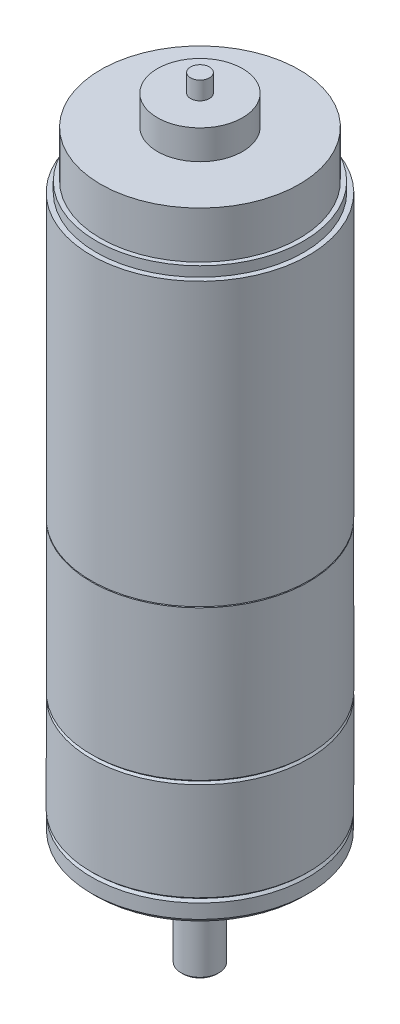
ISO-10303-21;
HEADER;
FILE_DESCRIPTION(('STEP AP214'),'2;1');
FILE_NAME('part.step','',(''),(''),'','','');
FILE_SCHEMA(('AUTOMOTIVE_DESIGN { 1 0 10303 214 1 1 1 1 }'));
ENDSEC;
DATA;
#1=APPLICATION_CONTEXT('core data for automotive mechanical design processes');
#2=APPLICATION_PROTOCOL_DEFINITION('international standard','automotive_design',2000,#1);
#3=PRODUCT_CONTEXT('',#1,'mechanical');
#4=PRODUCT('Part','Part','',(#3));
#5=PRODUCT_RELATED_PRODUCT_CATEGORY('part','',(#4));
#6=PRODUCT_DEFINITION_FORMATION('','',#4);
#7=PRODUCT_DEFINITION_CONTEXT('part definition',#1,'design');
#8=PRODUCT_DEFINITION('design','',#6,#7);
#9=PRODUCT_DEFINITION_SHAPE('','',#8);
#10=(LENGTH_UNIT() NAMED_UNIT(*) SI_UNIT(.MILLI.,.METRE.));
#11=(NAMED_UNIT(*) PLANE_ANGLE_UNIT() SI_UNIT($,.RADIAN.));
#12=(NAMED_UNIT(*) SI_UNIT($,.STERADIAN.) SOLID_ANGLE_UNIT());
#13=UNCERTAINTY_MEASURE_WITH_UNIT(LENGTH_MEASURE(1.E-05),#10,'distance_accuracy_value','');
#14=(GEOMETRIC_REPRESENTATION_CONTEXT(3) GLOBAL_UNCERTAINTY_ASSIGNED_CONTEXT((#13)) GLOBAL_UNIT_ASSIGNED_CONTEXT((#10,
#11,#12)) REPRESENTATION_CONTEXT('',''));
#15=CARTESIAN_POINT('',(0.,0.,0.));
#16=DIRECTION('',(0.,0.,1.));
#17=DIRECTION('',(1.,0.,0.));
#18=AXIS2_PLACEMENT_3D('',#15,#16,#17);
#19=CARTESIAN_POINT('',(0.,-14.,0.));
#20=DIRECTION('',(0.,1.,0.));
#21=DIRECTION('',(0.,0.,1.));
#22=AXIS2_PLACEMENT_3D('',#19,#20,#21);
#23=PLANE('',#22);
#24=CARTESIAN_POINT('',(0.,-14.0000000001237,0.));
#25=DIRECTION('',(0.,1.,0.));
#26=DIRECTION('',(0.,0.,1.));
#27=AXIS2_PLACEMENT_3D('',#24,#25,#26);
#28=CIRCLE('',#27,1.80000000023028);
#29=CARTESIAN_POINT('',(-1.4,-14.0000000001857,1.1313708501662));
#30=VERTEX_POINT('',#29);
#31=CARTESIAN_POINT('',(-1.4,-14.0000000000618,-1.13137085036326));
#32=VERTEX_POINT('',#31);
#33=EDGE_CURVE('E19',#30,#32,#28,.T.);
#34=ORIENTED_EDGE('',*,*,#33,.F.);
#35=DIRECTION('',(0.,0.,-1.));
#36=VECTOR('',#35,1.);
#37=CARTESIAN_POINT('',(-1.4,-14.,1.42828568570857));
#38=LINE('',#37,#36);
#39=EDGE_CURVE('E50',#30,#32,#38,.T.);
#40=ORIENTED_EDGE('',*,*,#39,.T.);
#41=EDGE_LOOP('',(#34,#40));
#42=FACE_BOUND('',#41,.T.);
#43=ADVANCED_FACE('F16',(#42),#23,.F.);
#44=CARTESIAN_POINT('',(0.,-13.8000000001739,0.));
#45=DIRECTION('',(0.,1.,0.));
#46=DIRECTION('',(0.,0.,1.));
#47=AXIS2_PLACEMENT_3D('',#44,#45,#46);
#48=CONICAL_SURFACE('',#47,1.99999999983902,0.785398162544797);
#49=CARTESIAN_POINT('',(-1.39999999995659,-14.0000000002279,-1.13137085005512));
#50=CARTESIAN_POINT('',(-1.39999999998432,-13.9841188437741,-1.1566353082275));
#51=CARTESIAN_POINT('',(-1.39999999999578,-13.9680096289815,-1.18175530232964));
#52=CARTESIAN_POINT('',(-1.40000000000422,-13.9353865044478,-1.23172354645879));
#53=CARTESIAN_POINT('',(-1.40000000000121,-13.9188726828804,-1.25657185401566));
#54=CARTESIAN_POINT('',(-1.39999999999879,-13.8854854387172,-1.30602395335101));
#55=CARTESIAN_POINT('',(-1.3999999999994,-13.8686120285243,-1.33062775352023));
#56=CARTESIAN_POINT('',(-1.4000000000006,-13.8345397217204,-1.37961693764071));
#57=CARTESIAN_POINT('',(-1.40000000000121,-13.8173407556094,-1.40400227327899));
#58=CARTESIAN_POINT('',(-1.4,-13.8000000000089,-1.42828568571488));
#59=B_SPLINE_CURVE_WITH_KNOTS('',3,(#49,#50,#51,#52,#53,#54,#55,#56,#57,#58),.UNSPECIFIED.,.F.,
.F.,(4,2,2,2,4),(0.,0.0895213707346501,0.179023403090901,0.268522353330887,0.358040630324946),.UNSPECIFIED.);
#60=CARTESIAN_POINT('',(-1.4,-13.8000000000043,-1.42828568571163));
#61=VERTEX_POINT('',#60);
#62=EDGE_CURVE('E52',#32,#61,#59,.T.);
#63=ORIENTED_EDGE('',*,*,#62,.T.);
#64=CARTESIAN_POINT('',(0.,-13.8,0.));
#65=DIRECTION('',(0.,1.,0.));
#66=DIRECTION('',(0.,0.,1.));
#67=AXIS2_PLACEMENT_3D('',#64,#65,#66);
#68=CIRCLE('',#67,2.);
#69=CARTESIAN_POINT('',(-1.4,-13.8000000000043,1.42828568571162));
#70=VERTEX_POINT('',#69);
#71=EDGE_CURVE('E380',#70,#61,#68,.T.);
#72=ORIENTED_EDGE('',*,*,#71,.F.);
#73=CARTESIAN_POINT('',(-1.4,-13.8000000000086,1.42828568571468));
#74=CARTESIAN_POINT('',(-1.4,-13.8173407556087,1.40400227327863));
#75=CARTESIAN_POINT('',(-1.4,-13.83453972172,1.37961693764065));
#76=CARTESIAN_POINT('',(-1.4,-13.8686120285244,1.33062775352066));
#77=CARTESIAN_POINT('',(-1.4,-13.8854854387176,1.30602395335163));
#78=CARTESIAN_POINT('',(-1.4,-13.9188726828796,1.25657185401565));
#79=CARTESIAN_POINT('',(-1.4,-13.9353865044455,1.23172354645797));
#80=CARTESIAN_POINT('',(-1.4,-13.9680096289831,1.18175530233164));
#81=CARTESIAN_POINT('',(-1.4,-13.984118843781,1.15663530823313));
#82=CARTESIAN_POINT('',(-1.4,-14.0000000002478,1.13137085006932));
#83=B_SPLINE_CURVE_WITH_KNOTS('',3,(#73,#74,#75,#76,#77,#78,#79,#80,#81,#82),.UNSPECIFIED.,.F.,
.F.,(4,2,2,2,4),(0.,0.0895182769938151,0.179017227233742,0.268519259589643,0.358040630323742),.UNSPECIFIED.);
#84=EDGE_CURVE('E53',#70,#30,#83,.T.);
#85=ORIENTED_EDGE('',*,*,#84,.T.);
#86=ORIENTED_EDGE('',*,*,#33,.T.);
#87=EDGE_LOOP('',(#63,#72,#85,#86));
#88=FACE_BOUND('',#87,.T.);
#89=ADVANCED_FACE('F56',(#88),#48,.T.);
#90=CARTESIAN_POINT('',(-1.4,-16.26,1.42828568570857));
#91=DIRECTION('',(1.,0.,0.));
#92=DIRECTION('',(0.,0.,-1.));
#93=AXIS2_PLACEMENT_3D('',#90,#91,#92);
#94=PLANE('',#93);
#95=ORIENTED_EDGE('',*,*,#62,.F.);
#96=ORIENTED_EDGE('',*,*,#39,.F.);
#97=ORIENTED_EDGE('',*,*,#84,.F.);
#98=DIRECTION('',(0.,1.,0.));
#99=VECTOR('',#98,1.);
#100=CARTESIAN_POINT('',(-1.4,-14.,1.42828568570857));
#101=LINE('',#100,#99);
#102=CARTESIAN_POINT('',(-1.4,-8.,1.42828568570857));
#103=VERTEX_POINT('',#102);
#104=EDGE_CURVE('E63',#103,#70,#101,.F.);
#105=ORIENTED_EDGE('',*,*,#104,.F.);
#106=DIRECTION('',(0.,0.,1.));
#107=VECTOR('',#106,1.);
#108=CARTESIAN_POINT('',(-1.4,-8.,0.));
#109=LINE('',#108,#107);
#110=CARTESIAN_POINT('',(-1.4,-8.,-1.42828568570857));
#111=VERTEX_POINT('',#110);
#112=EDGE_CURVE('E34',#103,#111,#109,.F.);
#113=ORIENTED_EDGE('',*,*,#112,.T.);
#114=DIRECTION('',(0.,1.,0.));
#115=VECTOR('',#114,1.);
#116=CARTESIAN_POINT('',(-1.4,-14.,-1.42828568570857));
#117=LINE('',#116,#115);
#118=EDGE_CURVE('E60',#61,#111,#117,.T.);
#119=ORIENTED_EDGE('',*,*,#118,.F.);
#120=EDGE_LOOP('',(#95,#96,#97,#105,#113,#119));
#121=FACE_BOUND('',#120,.T.);
#122=ADVANCED_FACE('F58',(#121),#94,.F.);
#123=CARTESIAN_POINT('',(0.,-8.,0.));
#124=DIRECTION('',(0.,1.,0.));
#125=DIRECTION('',(0.,0.,1.));
#126=AXIS2_PLACEMENT_3D('',#123,#124,#125);
#127=PLANE('',#126);
#128=CARTESIAN_POINT('',(0.,-8.,0.));
#129=DIRECTION('',(0.,1.,0.));
#130=DIRECTION('',(0.,0.,1.));
#131=AXIS2_PLACEMENT_3D('',#128,#129,#130);
#132=CIRCLE('',#131,2.);
#133=EDGE_CURVE('E71',#111,#103,#132,.T.);
#134=ORIENTED_EDGE('',*,*,#133,.F.);
#135=ORIENTED_EDGE('',*,*,#112,.F.);
#136=EDGE_LOOP('',(#134,#135));
#137=FACE_BOUND('',#136,.T.);
#138=ADVANCED_FACE('F87',(#137),#127,.F.);
#139=CARTESIAN_POINT('',(0.,-14.,0.));
#140=DIRECTION('',(0.,1.,0.));
#141=DIRECTION('',(0.,0.,1.));
#142=AXIS2_PLACEMENT_3D('',#139,#140,#141);
#143=CYLINDRICAL_SURFACE('',#142,2.);
#144=ORIENTED_EDGE('',*,*,#118,.T.);
#145=ORIENTED_EDGE('',*,*,#133,.T.);
#146=ORIENTED_EDGE('',*,*,#104,.T.);
#147=ORIENTED_EDGE('',*,*,#71,.T.);
#148=EDGE_LOOP('',(#144,#145,#146,#147));
#149=FACE_BOUND('',#148,.T.);
#150=CARTESIAN_POINT('',(0.,-2.9,0.));
#151=DIRECTION('',(0.,1.,0.));
#152=DIRECTION('',(0.,0.,1.));
#153=AXIS2_PLACEMENT_3D('',#150,#151,#152);
#154=CIRCLE('',#153,2.);
#155=CARTESIAN_POINT('',(0.,-2.9,1.99999999999999));
#156=VERTEX_POINT('',#155);
#157=EDGE_CURVE('E360',#156,#156,#154,.T.);
#158=ORIENTED_EDGE('',*,*,#157,.F.);
#159=EDGE_LOOP('',(#158));
#160=FACE_BOUND('',#159,.T.);
#161=ADVANCED_FACE('F366',(#149,#160),#143,.T.);
#162=CARTESIAN_POINT('',(0.,-2.9,0.));
#163=DIRECTION('',(0.,1.,0.));
#164=DIRECTION('',(0.,0.,1.));
#165=AXIS2_PLACEMENT_3D('',#162,#163,#164);
#166=TOROIDAL_SURFACE('',#165,2.2,0.2);
#167=ORIENTED_EDGE('',*,*,#157,.T.);
#168=EDGE_LOOP('',(#167));
#169=FACE_BOUND('',#168,.T.);
#170=CARTESIAN_POINT('',(0.,-3.1,0.));
#171=DIRECTION('',(0.,-1.,0.));
#172=DIRECTION('',(0.,0.,1.));
#173=AXIS2_PLACEMENT_3D('',#170,#171,#172);
#174=CIRCLE('',#173,2.2);
#175=CARTESIAN_POINT('',(0.,-3.1,2.19999999999999));
#176=VERTEX_POINT('',#175);
#177=EDGE_CURVE('E499',#176,#176,#174,.T.);
#178=ORIENTED_EDGE('',*,*,#177,.T.);
#179=EDGE_LOOP('',(#178));
#180=FACE_BOUND('',#179,.T.);
#181=ADVANCED_FACE('F362',(#169,#180),#166,.T.);
#182=CARTESIAN_POINT('',(0.,-3.1,2.99999999999999));
#183=DIRECTION('',(0.,1.,0.));
#184=DIRECTION('',(0.,0.,1.));
#185=AXIS2_PLACEMENT_3D('',#182,#183,#184);
#186=PLANE('',#185);
#187=CARTESIAN_POINT('',(0.,-3.1,0.));
#188=DIRECTION('',(0.,1.,0.));
#189=DIRECTION('',(0.,0.,1.));
#190=AXIS2_PLACEMENT_3D('',#187,#188,#189);
#191=CIRCLE('',#190,2.9);
#192=CARTESIAN_POINT('',(0.,-3.1,2.89999999999999));
#193=VERTEX_POINT('',#192);
#194=EDGE_CURVE('E321',#193,#193,#191,.T.);
#195=ORIENTED_EDGE('',*,*,#194,.F.);
#196=EDGE_LOOP('',(#195));
#197=FACE_BOUND('',#196,.T.);
#198=ORIENTED_EDGE('',*,*,#177,.F.);
#199=EDGE_LOOP('',(#198));
#200=FACE_BOUND('',#199,.T.);
#201=ADVANCED_FACE('F342',(#197,#200),#186,.F.);
#202=CARTESIAN_POINT('',(0.,-3.,0.));
#203=DIRECTION('',(0.,1.,0.));
#204=DIRECTION('',(0.,0.,1.));
#205=AXIS2_PLACEMENT_3D('',#202,#203,#204);
#206=TOROIDAL_SURFACE('',#205,2.9,0.1);
#207=CARTESIAN_POINT('',(0.,-3.,0.));
#208=DIRECTION('',(0.,1.,0.));
#209=DIRECTION('',(0.,0.,1.));
#210=AXIS2_PLACEMENT_3D('',#207,#208,#209);
#211=CIRCLE('',#210,3.);
#212=CARTESIAN_POINT('',(0.,-3.,2.99999999999999));
#213=VERTEX_POINT('',#212);
#214=EDGE_CURVE('E318',#213,#213,#211,.F.);
#215=ORIENTED_EDGE('',*,*,#214,.T.);
#216=EDGE_LOOP('',(#215));
#217=FACE_BOUND('',#216,.T.);
#218=ORIENTED_EDGE('',*,*,#194,.T.);
#219=EDGE_LOOP('',(#218));
#220=FACE_BOUND('',#219,.T.);
#221=ADVANCED_FACE('F338',(#217,#220),#206,.T.);
#222=CARTESIAN_POINT('',(0.,-3.,0.));
#223=DIRECTION('',(0.,1.,0.));
#224=DIRECTION('',(0.,0.,1.));
#225=AXIS2_PLACEMENT_3D('',#222,#223,#224);
#226=TOROIDAL_SURFACE('',#225,3.1,0.1);
#227=ORIENTED_EDGE('',*,*,#214,.F.);
#228=EDGE_LOOP('',(#227));
#229=FACE_BOUND('',#228,.T.);
#230=CARTESIAN_POINT('',(0.,-2.9,0.));
#231=DIRECTION('',(0.,-1.,0.));
#232=DIRECTION('',(0.,0.,1.));
#233=AXIS2_PLACEMENT_3D('',#230,#231,#232);
#234=CIRCLE('',#233,3.1);
#235=CARTESIAN_POINT('',(0.,-2.9,3.09999999999999));
#236=VERTEX_POINT('',#235);
#237=EDGE_CURVE('E276',#236,#236,#234,.T.);
#238=ORIENTED_EDGE('',*,*,#237,.T.);
#239=EDGE_LOOP('',(#238));
#240=FACE_BOUND('',#239,.T.);
#241=ADVANCED_FACE('F291',(#229,#240),#226,.F.);
#242=CARTESIAN_POINT('',(0.,-2.9,4.49999999999999));
#243=DIRECTION('',(0.,1.,0.));
#244=DIRECTION('',(0.,0.,1.));
#245=AXIS2_PLACEMENT_3D('',#242,#243,#244);
#246=PLANE('',#245);
#247=CARTESIAN_POINT('',(0.,-2.9,0.));
#248=DIRECTION('',(0.,1.,0.));
#249=DIRECTION('',(0.,0.,1.));
#250=AXIS2_PLACEMENT_3D('',#247,#248,#249);
#251=CIRCLE('',#250,4.4);
#252=CARTESIAN_POINT('',(0.,-2.9,4.39999999999999));
#253=VERTEX_POINT('',#252);
#254=EDGE_CURVE('E308',#253,#253,#251,.F.);
#255=ORIENTED_EDGE('',*,*,#254,.T.);
#256=EDGE_LOOP('',(#255));
#257=FACE_BOUND('',#256,.T.);
#258=ORIENTED_EDGE('',*,*,#237,.F.);
#259=EDGE_LOOP('',(#258));
#260=FACE_BOUND('',#259,.T.);
#261=ADVANCED_FACE('F282',(#257,#260),#246,.F.);
#262=CARTESIAN_POINT('',(0.,-3.,0.));
#263=DIRECTION('',(0.,1.,0.));
#264=DIRECTION('',(0.,0.,1.));
#265=AXIS2_PLACEMENT_3D('',#262,#263,#264);
#266=TOROIDAL_SURFACE('',#265,4.4,0.1);
#267=ORIENTED_EDGE('',*,*,#254,.F.);
#268=EDGE_LOOP('',(#267));
#269=FACE_BOUND('',#268,.T.);
#270=CARTESIAN_POINT('',(0.,-3.,0.));
#271=DIRECTION('',(0.,1.,0.));
#272=DIRECTION('',(0.,0.,1.));
#273=AXIS2_PLACEMENT_3D('',#270,#271,#272);
#274=CIRCLE('',#273,4.5);
#275=CARTESIAN_POINT('',(0.,-3.,4.49999999999999));
#276=VERTEX_POINT('',#275);
#277=EDGE_CURVE('E249',#276,#276,#274,.T.);
#278=ORIENTED_EDGE('',*,*,#277,.F.);
#279=EDGE_LOOP('',(#278));
#280=FACE_BOUND('',#279,.T.);
#281=ADVANCED_FACE('F255',(#269,#280),#266,.F.);
#282=CARTESIAN_POINT('',(0.,-3.,0.));
#283=DIRECTION('',(0.,1.,0.));
#284=DIRECTION('',(0.,0.,1.));
#285=AXIS2_PLACEMENT_3D('',#282,#283,#284);
#286=TOROIDAL_SURFACE('',#285,4.6,0.1);
#287=ORIENTED_EDGE('',*,*,#277,.T.);
#288=EDGE_LOOP('',(#287));
#289=FACE_BOUND('',#288,.T.);
#290=CARTESIAN_POINT('',(0.,-3.1,0.));
#291=DIRECTION('',(0.,-1.,0.));
#292=DIRECTION('',(0.,0.,1.));
#293=AXIS2_PLACEMENT_3D('',#290,#291,#292);
#294=CIRCLE('',#293,4.6);
#295=CARTESIAN_POINT('',(0.,-3.1,4.59999999999999));
#296=VERTEX_POINT('',#295);
#297=EDGE_CURVE('E863',#296,#296,#294,.T.);
#298=ORIENTED_EDGE('',*,*,#297,.T.);
#299=EDGE_LOOP('',(#298));
#300=FACE_BOUND('',#299,.T.);
#301=ADVANCED_FACE('F251',(#289,#300),#286,.T.);
#302=CARTESIAN_POINT('',(0.,-3.1,5.79999999999999));
#303=DIRECTION('',(0.,1.,0.));
#304=DIRECTION('',(0.,0.,1.));
#305=AXIS2_PLACEMENT_3D('',#302,#303,#304);
#306=PLANE('',#305);
#307=CARTESIAN_POINT('',(0.,-3.1,0.));
#308=DIRECTION('',(0.,1.,0.));
#309=DIRECTION('',(0.,0.,1.));
#310=AXIS2_PLACEMENT_3D('',#307,#308,#309);
#311=CIRCLE('',#310,5.7);
#312=CARTESIAN_POINT('',(0.,-3.1,5.69999999999999));
#313=VERTEX_POINT('',#312);
#314=EDGE_CURVE('E218',#313,#313,#311,.T.);
#315=ORIENTED_EDGE('',*,*,#314,.F.);
#316=EDGE_LOOP('',(#315));
#317=FACE_BOUND('',#316,.T.);
#318=ORIENTED_EDGE('',*,*,#297,.F.);
#319=EDGE_LOOP('',(#318));
#320=FACE_BOUND('',#319,.T.);
#321=ADVANCED_FACE('F231',(#317,#320),#306,.F.);
#322=CARTESIAN_POINT('',(0.,-3.,0.));
#323=DIRECTION('',(0.,1.,0.));
#324=DIRECTION('',(0.,0.,1.));
#325=AXIS2_PLACEMENT_3D('',#322,#323,#324);
#326=TOROIDAL_SURFACE('',#325,5.7,0.1);
#327=ORIENTED_EDGE('',*,*,#314,.T.);
#328=EDGE_LOOP('',(#327));
#329=FACE_BOUND('',#328,.T.);
#330=CARTESIAN_POINT('',(0.,-3.,0.));
#331=DIRECTION('',(0.,-1.,0.));
#332=DIRECTION('',(0.,0.,-1.));
#333=AXIS2_PLACEMENT_3D('',#330,#331,#332);
#334=CIRCLE('',#333,5.8);
#335=CARTESIAN_POINT('',(0.,-3.,-5.80000000000001));
#336=VERTEX_POINT('',#335);
#337=EDGE_CURVE('E202',#336,#336,#334,.F.);
#338=ORIENTED_EDGE('',*,*,#337,.F.);
#339=EDGE_LOOP('',(#338));
#340=FACE_BOUND('',#339,.T.);
#341=ADVANCED_FACE('F226',(#329,#340),#326,.T.);
#342=CARTESIAN_POINT('',(0.,-3.1,0.));
#343=DIRECTION('',(0.,-1.,0.));
#344=DIRECTION('',(0.,0.,-1.));
#345=AXIS2_PLACEMENT_3D('',#342,#343,#344);
#346=CYLINDRICAL_SURFACE('',#345,5.8);
#347=ORIENTED_EDGE('',*,*,#337,.T.);
#348=EDGE_LOOP('',(#347));
#349=FACE_BOUND('',#348,.T.);
#350=CARTESIAN_POINT('',(0.,-2.4,0.));
#351=DIRECTION('',(0.,-1.,0.));
#352=DIRECTION('',(0.,0.,-1.));
#353=AXIS2_PLACEMENT_3D('',#350,#351,#352);
#354=CIRCLE('',#353,5.8);
#355=CARTESIAN_POINT('',(0.,-2.4,-5.80000000000001));
#356=VERTEX_POINT('',#355);
#357=EDGE_CURVE('E198',#356,#356,#354,.F.);
#358=ORIENTED_EDGE('',*,*,#357,.F.);
#359=EDGE_LOOP('',(#358));
#360=FACE_BOUND('',#359,.T.);
#361=ADVANCED_FACE('F230',(#349,#360),#346,.T.);
#362=CARTESIAN_POINT('',(0.,-2.4,0.));
#363=DIRECTION('',(0.,-1.,0.));
#364=DIRECTION('',(0.,0.,-1.));
#365=AXIS2_PLACEMENT_3D('',#362,#363,#364);
#366=TOROIDAL_SURFACE('',#365,5.7,0.1);
#367=ORIENTED_EDGE('',*,*,#357,.T.);
#368=EDGE_LOOP('',(#367));
#369=FACE_BOUND('',#368,.T.);
#370=CARTESIAN_POINT('',(0.,-2.3,0.));
#371=DIRECTION('',(0.,-1.,0.));
#372=DIRECTION('',(0.,0.,-1.));
#373=AXIS2_PLACEMENT_3D('',#370,#371,#372);
#374=CIRCLE('',#373,5.7);
#375=CARTESIAN_POINT('',(0.,-2.3,-5.70000000000001));
#376=VERTEX_POINT('',#375);
#377=EDGE_CURVE('E201',#376,#376,#374,.F.);
#378=ORIENTED_EDGE('',*,*,#377,.F.);
#379=EDGE_LOOP('',(#378));
#380=FACE_BOUND('',#379,.T.);
#381=ADVANCED_FACE('F180',(#369,#380),#366,.T.);
#382=CARTESIAN_POINT('',(0.,-2.3,5.));
#383=DIRECTION('',(0.,-1.,0.));
#384=DIRECTION('',(0.,0.,-1.));
#385=AXIS2_PLACEMENT_3D('',#382,#383,#384);
#386=PLANE('',#385);
#387=CARTESIAN_POINT('',(0.,-2.3,0.));
#388=DIRECTION('',(0.,1.,0.));
#389=DIRECTION('',(0.,0.,1.));
#390=AXIS2_PLACEMENT_3D('',#387,#388,#389);
#391=CIRCLE('',#390,10.97);
#392=CARTESIAN_POINT('',(0.,-2.3,10.97));
#393=VERTEX_POINT('',#392);
#394=EDGE_CURVE('E424',#393,#393,#391,.T.);
#395=ORIENTED_EDGE('',*,*,#394,.F.);
#396=EDGE_LOOP('',(#395));
#397=FACE_BOUND('',#396,.T.);
#398=ORIENTED_EDGE('',*,*,#377,.T.);
#399=EDGE_LOOP('',(#398));
#400=FACE_BOUND('',#399,.T.);
#401=ADVANCED_FACE('F175',(#397,#400),#386,.T.);
#402=CARTESIAN_POINT('',(0.,-1.79999999955128,0.));
#403=DIRECTION('',(0.,1.,0.));
#404=DIRECTION('',(0.,0.,1.));
#405=AXIS2_PLACEMENT_3D('',#402,#403,#404);
#406=CONICAL_SURFACE('',#405,11.4699999995513,0.785398162499998);
#407=ORIENTED_EDGE('',*,*,#394,.T.);
#408=EDGE_LOOP('',(#407));
#409=FACE_BOUND('',#408,.T.);
#410=CARTESIAN_POINT('',(0.,-1.8,0.));
#411=DIRECTION('',(0.,-1.,0.));
#412=DIRECTION('',(0.,0.,-1.));
#413=AXIS2_PLACEMENT_3D('',#410,#411,#412);
#414=CIRCLE('',#413,11.47);
#415=CARTESIAN_POINT('',(0.,-1.8,-11.47));
#416=VERTEX_POINT('',#415);
#417=EDGE_CURVE('E426',#416,#416,#414,.F.);
#418=ORIENTED_EDGE('',*,*,#417,.F.);
#419=EDGE_LOOP('',(#418));
#420=FACE_BOUND('',#419,.T.);
#421=ADVANCED_FACE('F171',(#409,#420),#406,.T.);
#422=CARTESIAN_POINT('',(0.,19.3,0.));
#423=DIRECTION('',(0.,-1.,0.));
#424=DIRECTION('',(0.,0.,-1.));
#425=AXIS2_PLACEMENT_3D('',#422,#423,#424);
#426=CYLINDRICAL_SURFACE('',#425,11.47);
#427=CARTESIAN_POINT('',(0.,-0.300000000000002,0.));
#428=DIRECTION('',(0.,-1.,0.));
#429=DIRECTION('',(0.,0.,-1.));
#430=AXIS2_PLACEMENT_3D('',#427,#428,#429);
#431=CIRCLE('',#430,11.47);
#432=CARTESIAN_POINT('',(0.,-0.299999999999999,-11.47));
#433=VERTEX_POINT('',#432);
#434=EDGE_CURVE('E423',#433,#433,#431,.F.);
#435=ORIENTED_EDGE('',*,*,#434,.F.);
#436=EDGE_LOOP('',(#435));
#437=FACE_BOUND('',#436,.T.);
#438=ORIENTED_EDGE('',*,*,#417,.T.);
#439=EDGE_LOOP('',(#438));
#440=FACE_BOUND('',#439,.T.);
#441=ADVANCED_FACE('F167',(#437,#440),#426,.T.);
#442=CARTESIAN_POINT('',(0.,67.65,0.));
#443=DIRECTION('',(0.,-1.,0.));
#444=DIRECTION('',(0.,0.,-1.));
#445=AXIS2_PLACEMENT_3D('',#442,#443,#444);
#446=PLANE('',#445);
#447=CARTESIAN_POINT('',(0.,67.65,0.));
#448=DIRECTION('',(0.,-1.,0.));
#449=DIRECTION('',(0.,0.,-1.));
#450=AXIS2_PLACEMENT_3D('',#447,#448,#449);
#451=CIRCLE('',#450,1.);
#452=CARTESIAN_POINT('',(0.,67.65,-1.));
#453=VERTEX_POINT('',#452);
#454=EDGE_CURVE('E421',#453,#453,#451,.T.);
#455=ORIENTED_EDGE('',*,*,#454,.F.);
#456=EDGE_LOOP('',(#455));
#457=FACE_BOUND('',#456,.T.);
#458=ADVANCED_FACE('F163',(#457),#446,.F.);
#459=CARTESIAN_POINT('',(0.,-0.300000000000002,0.));
#460=DIRECTION('',(0.,-1.,0.));
#461=DIRECTION('',(0.,0.,-1.));
#462=AXIS2_PLACEMENT_3D('',#459,#460,#461);
#463=CONICAL_SURFACE('',#462,11.47,0.785398162499996);
#464=ORIENTED_EDGE('',*,*,#434,.T.);
#465=EDGE_LOOP('',(#464));
#466=FACE_BOUND('',#465,.T.);
#467=CARTESIAN_POINT('',(0.,2.69233095019639E-10,0.));
#468=DIRECTION('',(0.,-1.,0.));
#469=DIRECTION('',(0.,0.,-1.));
#470=AXIS2_PLACEMENT_3D('',#467,#468,#469);
#471=CIRCLE('',#470,11.1700000002692);
#472=CARTESIAN_POINT('',(0.,2.69236552910905E-10,-11.1700000002692));
#473=VERTEX_POINT('',#472);
#474=EDGE_CURVE('E418',#473,#473,#471,.F.);
#475=ORIENTED_EDGE('',*,*,#474,.F.);
#476=EDGE_LOOP('',(#475));
#477=FACE_BOUND('',#476,.T.);
#478=ADVANCED_FACE('F159',(#466,#477),#463,.T.);
#479=CARTESIAN_POINT('',(0.,67.65,0.));
#480=DIRECTION('',(0.,-1.,0.));
#481=DIRECTION('',(0.,0.,-1.));
#482=AXIS2_PLACEMENT_3D('',#479,#480,#481);
#483=CYLINDRICAL_SURFACE('',#482,1.);
#484=CARTESIAN_POINT('',(0.,65.75,0.));
#485=DIRECTION('',(0.,-1.,0.));
#486=DIRECTION('',(0.,0.,-1.));
#487=AXIS2_PLACEMENT_3D('',#484,#485,#486);
#488=CIRCLE('',#487,1.);
#489=CARTESIAN_POINT('',(0.,65.75,-1.));
#490=VERTEX_POINT('',#489);
#491=EDGE_CURVE('E415',#490,#490,#488,.F.);
#492=ORIENTED_EDGE('',*,*,#491,.T.);
#493=EDGE_LOOP('',(#492));
#494=FACE_BOUND('',#493,.T.);
#495=ORIENTED_EDGE('',*,*,#454,.T.);
#496=EDGE_LOOP('',(#495));
#497=FACE_BOUND('',#496,.T.);
#498=ADVANCED_FACE('F155',(#494,#497),#483,.T.);
#499=CARTESIAN_POINT('',(0.,0.,9.5));
#500=DIRECTION('',(0.,-1.,0.));
#501=DIRECTION('',(0.,0.,-1.));
#502=AXIS2_PLACEMENT_3D('',#499,#500,#501);
#503=PLANE('',#502);
#504=CARTESIAN_POINT('',(0.,0.,0.));
#505=DIRECTION('',(0.,1.,0.));
#506=DIRECTION('',(0.,0.,1.));
#507=AXIS2_PLACEMENT_3D('',#504,#505,#506);
#508=CIRCLE('',#507,11.3);
#509=CARTESIAN_POINT('',(0.,0.,11.3));
#510=VERTEX_POINT('',#509);
#511=EDGE_CURVE('E412',#510,#510,#508,.T.);
#512=ORIENTED_EDGE('',*,*,#511,.F.);
#513=EDGE_LOOP('',(#512));
#514=FACE_BOUND('',#513,.T.);
#515=ORIENTED_EDGE('',*,*,#474,.T.);
#516=EDGE_LOOP('',(#515));
#517=FACE_BOUND('',#516,.T.);
#518=ADVANCED_FACE('F151',(#514,#517),#503,.T.);
#519=CARTESIAN_POINT('',(0.,65.75,0.));
#520=DIRECTION('',(0.,-1.,0.));
#521=DIRECTION('',(0.,0.,-1.));
#522=AXIS2_PLACEMENT_3D('',#519,#520,#521);
#523=PLANE('',#522);
#524=CARTESIAN_POINT('',(0.,65.75,0.));
#525=DIRECTION('',(0.,-1.,0.));
#526=DIRECTION('',(0.,0.,-1.));
#527=AXIS2_PLACEMENT_3D('',#524,#525,#526);
#528=CIRCLE('',#527,4.5);
#529=CARTESIAN_POINT('',(0.,65.75,-4.5));
#530=VERTEX_POINT('',#529);
#531=EDGE_CURVE('E409',#530,#530,#528,.T.);
#532=ORIENTED_EDGE('',*,*,#531,.F.);
#533=EDGE_LOOP('',(#532));
#534=FACE_BOUND('',#533,.T.);
#535=ORIENTED_EDGE('',*,*,#491,.F.);
#536=EDGE_LOOP('',(#535));
#537=FACE_BOUND('',#536,.T.);
#538=ADVANCED_FACE('F147',(#534,#537),#523,.F.);
#539=CARTESIAN_POINT('',(0.,0.200000000179489,0.));
#540=DIRECTION('',(0.,1.,0.));
#541=DIRECTION('',(0.,0.,1.));
#542=AXIS2_PLACEMENT_3D('',#539,#540,#541);
#543=CONICAL_SURFACE('',#542,11.4999999998205,0.785398162500004);
#544=ORIENTED_EDGE('',*,*,#511,.T.);
#545=EDGE_LOOP('',(#544));
#546=FACE_BOUND('',#545,.T.);
#547=CARTESIAN_POINT('',(0.,0.200000000000002,0.));
#548=DIRECTION('',(0.,-1.,0.));
#549=DIRECTION('',(0.,0.,-1.));
#550=AXIS2_PLACEMENT_3D('',#547,#548,#549);
#551=CIRCLE('',#550,11.5);
#552=CARTESIAN_POINT('',(0.,0.200000000000006,-11.5));
#553=VERTEX_POINT('',#552);
#554=EDGE_CURVE('E408',#553,#553,#551,.F.);
#555=ORIENTED_EDGE('',*,*,#554,.F.);
#556=EDGE_LOOP('',(#555));
#557=FACE_BOUND('',#556,.T.);
#558=ADVANCED_FACE('F143',(#546,#557),#543,.T.);
#559=CARTESIAN_POINT('',(0.,65.75,0.));
#560=DIRECTION('',(0.,-1.,0.));
#561=DIRECTION('',(0.,0.,-1.));
#562=AXIS2_PLACEMENT_3D('',#559,#560,#561);
#563=CYLINDRICAL_SURFACE('',#562,4.5);
#564=CARTESIAN_POINT('',(0.,62.65,0.));
#565=DIRECTION('',(0.,-1.,0.));
#566=DIRECTION('',(0.,0.,-1.));
#567=AXIS2_PLACEMENT_3D('',#564,#565,#566);
#568=CIRCLE('',#567,4.5);
#569=CARTESIAN_POINT('',(0.,62.65,-4.5));
#570=VERTEX_POINT('',#569);
#571=EDGE_CURVE('E405',#570,#570,#568,.T.);
#572=ORIENTED_EDGE('',*,*,#571,.F.);
#573=EDGE_LOOP('',(#572));
#574=FACE_BOUND('',#573,.T.);
#575=ORIENTED_EDGE('',*,*,#531,.T.);
#576=EDGE_LOOP('',(#575));
#577=FACE_BOUND('',#576,.T.);
#578=ADVANCED_FACE('F139',(#574,#577),#563,.T.);
#579=CARTESIAN_POINT('',(0.,21.6,0.));
#580=DIRECTION('',(0.,-1.,0.));
#581=DIRECTION('',(0.,0.,-1.));
#582=AXIS2_PLACEMENT_3D('',#579,#580,#581);
#583=CYLINDRICAL_SURFACE('',#582,11.5);
#584=CARTESIAN_POINT('',(0.,10.55,0.));
#585=DIRECTION('',(0.,-1.,0.));
#586=DIRECTION('',(0.,0.,-1.));
#587=AXIS2_PLACEMENT_3D('',#584,#585,#586);
#588=CIRCLE('',#587,11.5);
#589=CARTESIAN_POINT('',(0.,10.55,-11.5));
#590=VERTEX_POINT('',#589);
#591=EDGE_CURVE('E404',#590,#590,#588,.F.);
#592=ORIENTED_EDGE('',*,*,#591,.F.);
#593=EDGE_LOOP('',(#592));
#594=FACE_BOUND('',#593,.T.);
#595=ORIENTED_EDGE('',*,*,#554,.T.);
#596=EDGE_LOOP('',(#595));
#597=FACE_BOUND('',#596,.T.);
#598=ADVANCED_FACE('F135',(#594,#597),#583,.T.);
#599=CARTESIAN_POINT('',(0.,62.65,0.));
#600=DIRECTION('',(0.,1.,0.));
#601=DIRECTION('',(0.,0.,1.));
#602=AXIS2_PLACEMENT_3D('',#599,#600,#601);
#603=PLANE('',#602);
#604=CARTESIAN_POINT('',(0.,62.65,0.));
#605=DIRECTION('',(0.,1.,0.));
#606=DIRECTION('',(0.,0.,1.));
#607=AXIS2_PLACEMENT_3D('',#604,#605,#606);
#608=CIRCLE('',#607,10.5);
#609=CARTESIAN_POINT('',(0.,62.65,10.5));
#610=VERTEX_POINT('',#609);
#611=EDGE_CURVE('E401',#610,#610,#608,.F.);
#612=ORIENTED_EDGE('',*,*,#611,.F.);
#613=EDGE_LOOP('',(#612));
#614=FACE_BOUND('',#613,.T.);
#615=ORIENTED_EDGE('',*,*,#571,.T.);
#616=EDGE_LOOP('',(#615));
#617=FACE_BOUND('',#616,.T.);
#618=ADVANCED_FACE('F131',(#614,#617),#603,.T.);
#619=CARTESIAN_POINT('',(0.,10.55,0.));
#620=DIRECTION('',(0.,-1.,0.));
#621=DIRECTION('',(0.,0.,-1.));
#622=AXIS2_PLACEMENT_3D('',#619,#620,#621);
#623=CONICAL_SURFACE('',#622,11.5,0.785398162499998);
#624=ORIENTED_EDGE('',*,*,#591,.T.);
#625=EDGE_LOOP('',(#624));
#626=FACE_BOUND('',#625,.T.);
#627=CARTESIAN_POINT('',(0.,10.7499999998205,0.));
#628=DIRECTION('',(0.,1.,0.));
#629=DIRECTION('',(-0.837169104331222,0.,-0.546944138603989));
#630=AXIS2_PLACEMENT_3D('',#627,#628,#629);
#631=CIRCLE('',#630,11.3000000001795);
#632=CARTESIAN_POINT('',(-9.46001087909307,10.7499999998205,-6.18046876632325));
#633=VERTEX_POINT('',#632);
#634=EDGE_CURVE('E400',#633,#633,#631,.T.);
#635=ORIENTED_EDGE('',*,*,#634,.F.);
#636=EDGE_LOOP('',(#635));
#637=FACE_BOUND('',#636,.T.);
#638=ADVANCED_FACE('F127',(#626,#637),#623,.T.);
#639=CARTESIAN_POINT('',(0.,56.65,0.));
#640=DIRECTION('',(0.,1.,0.));
#641=DIRECTION('',(0.,0.,1.));
#642=AXIS2_PLACEMENT_3D('',#639,#640,#641);
#643=CYLINDRICAL_SURFACE('',#642,10.5);
#644=CARTESIAN_POINT('',(0.,57.7,0.));
#645=DIRECTION('',(0.,1.,0.));
#646=DIRECTION('',(0.,0.,1.));
#647=AXIS2_PLACEMENT_3D('',#644,#645,#646);
#648=CIRCLE('',#647,10.5);
#649=CARTESIAN_POINT('',(0.,57.7,10.5));
#650=VERTEX_POINT('',#649);
#651=EDGE_CURVE('E397',#650,#650,#648,.T.);
#652=ORIENTED_EDGE('',*,*,#651,.T.);
#653=EDGE_LOOP('',(#652));
#654=FACE_BOUND('',#653,.T.);
#655=ORIENTED_EDGE('',*,*,#611,.T.);
#656=EDGE_LOOP('',(#655));
#657=FACE_BOUND('',#656,.T.);
#658=ADVANCED_FACE('F123',(#654,#657),#643,.T.);
#659=CARTESIAN_POINT('',(0.,10.95,0.));
#660=DIRECTION('',(0.,1.,0.));
#661=DIRECTION('',(0.,0.,1.));
#662=AXIS2_PLACEMENT_3D('',#659,#660,#661);
#663=CONICAL_SURFACE('',#662,11.5,0.785398162500002);
#664=CARTESIAN_POINT('',(0.,10.95,0.));
#665=DIRECTION('',(0.,-1.,0.));
#666=DIRECTION('',(0.,0.,-1.));
#667=AXIS2_PLACEMENT_3D('',#664,#665,#666);
#668=CIRCLE('',#667,11.5);
#669=CARTESIAN_POINT('',(0.,10.95,-11.5));
#670=VERTEX_POINT('',#669);
#671=EDGE_CURVE('E396',#670,#670,#668,.F.);
#672=ORIENTED_EDGE('',*,*,#671,.F.);
#673=EDGE_LOOP('',(#672));
#674=FACE_BOUND('',#673,.T.);
#675=ORIENTED_EDGE('',*,*,#634,.T.);
#676=EDGE_LOOP('',(#675));
#677=FACE_BOUND('',#676,.T.);
#678=ADVANCED_FACE('F119',(#674,#677),#663,.T.);
#679=CARTESIAN_POINT('',(0.,57.7,0.));
#680=DIRECTION('',(0.,-1.,0.));
#681=DIRECTION('',(0.,0.,-1.));
#682=AXIS2_PLACEMENT_3D('',#679,#680,#681);
#683=PLANE('',#682);
#684=CARTESIAN_POINT('',(0.,57.7,0.));
#685=DIRECTION('',(0.,-1.,0.));
#686=DIRECTION('',(0.,0.,-1.));
#687=AXIS2_PLACEMENT_3D('',#684,#685,#686);
#688=CIRCLE('',#687,10.97);
#689=CARTESIAN_POINT('',(0.,57.7,-10.97));
#690=VERTEX_POINT('',#689);
#691=EDGE_CURVE('E393',#690,#690,#688,.T.);
#692=ORIENTED_EDGE('',*,*,#691,.F.);
#693=EDGE_LOOP('',(#692));
#694=FACE_BOUND('',#693,.T.);
#695=ORIENTED_EDGE('',*,*,#651,.F.);
#696=EDGE_LOOP('',(#695));
#697=FACE_BOUND('',#696,.T.);
#698=ADVANCED_FACE('F115',(#694,#697),#683,.F.);
#699=CARTESIAN_POINT('',(0.,27.95,0.));
#700=DIRECTION('',(0.,-1.,0.));
#701=DIRECTION('',(0.,0.,-1.));
#702=AXIS2_PLACEMENT_3D('',#699,#700,#701);
#703=CYLINDRICAL_SURFACE('',#702,11.5);
#704=ORIENTED_EDGE('',*,*,#671,.T.);
#705=EDGE_LOOP('',(#704));
#706=FACE_BOUND('',#705,.T.);
#707=CARTESIAN_POINT('',(0.,26.7499999998205,0.));
#708=DIRECTION('',(0.,-1.,0.));
#709=DIRECTION('',(0.837169104331222,0.,0.546944138603989));
#710=AXIS2_PLACEMENT_3D('',#707,#708,#709);
#711=CIRCLE('',#710,11.4999999998205);
#712=CARTESIAN_POINT('',(9.62744469965879,26.7499999998205,6.2898575938477));
#713=VERTEX_POINT('',#712);
#714=EDGE_CURVE('E392',#713,#713,#711,.F.);
#715=ORIENTED_EDGE('',*,*,#714,.F.);
#716=EDGE_LOOP('',(#715));
#717=FACE_BOUND('',#716,.T.);
#718=ADVANCED_FACE('F111',(#706,#717),#703,.T.);
#719=CARTESIAN_POINT('',(0.,57.7,0.));
#720=DIRECTION('',(0.,-1.,0.));
#721=DIRECTION('',(0.,0.,-1.));
#722=AXIS2_PLACEMENT_3D('',#719,#720,#721);
#723=CYLINDRICAL_SURFACE('',#722,10.97);
#724=ORIENTED_EDGE('',*,*,#691,.T.);
#725=EDGE_LOOP('',(#724));
#726=FACE_BOUND('',#725,.T.);
#727=CARTESIAN_POINT('',(0.,56.65,0.));
#728=DIRECTION('',(0.,-1.,0.));
#729=DIRECTION('',(0.,0.,-1.));
#730=AXIS2_PLACEMENT_3D('',#727,#728,#729);
#731=CIRCLE('',#730,10.97);
#732=CARTESIAN_POINT('',(0.,56.65,-10.97));
#733=VERTEX_POINT('',#732);
#734=EDGE_CURVE('E389',#733,#733,#731,.T.);
#735=ORIENTED_EDGE('',*,*,#734,.F.);
#736=EDGE_LOOP('',(#735));
#737=FACE_BOUND('',#736,.T.);
#738=ADVANCED_FACE('F107',(#726,#737),#723,.T.);
#739=CARTESIAN_POINT('',(0.,26.7499999998205,0.));
#740=DIRECTION('',(0.,-1.,0.));
#741=DIRECTION('',(0.,0.,-1.));
#742=AXIS2_PLACEMENT_3D('',#739,#740,#741);
#743=CONICAL_SURFACE('',#742,11.4999999998205,0.785398162499998);
#744=ORIENTED_EDGE('',*,*,#714,.T.);
#745=EDGE_LOOP('',(#744));
#746=FACE_BOUND('',#745,.T.);
#747=CARTESIAN_POINT('',(0.,26.8499999999103,0.));
#748=DIRECTION('',(0.,-1.,0.));
#749=DIRECTION('',(0.,0.,-1.));
#750=AXIS2_PLACEMENT_3D('',#747,#748,#749);
#751=CIRCLE('',#750,11.3999999999103);
#752=CARTESIAN_POINT('',(0.,26.8499999999103,-11.3999999999103));
#753=VERTEX_POINT('',#752);
#754=EDGE_CURVE('E386',#753,#753,#751,.F.);
#755=ORIENTED_EDGE('',*,*,#754,.F.);
#756=EDGE_LOOP('',(#755));
#757=FACE_BOUND('',#756,.T.);
#758=ADVANCED_FACE('F103',(#746,#757),#743,.T.);
#759=CARTESIAN_POINT('',(0.,56.65,0.));
#760=DIRECTION('',(0.,1.,0.));
#761=DIRECTION('',(0.,0.,1.));
#762=AXIS2_PLACEMENT_3D('',#759,#760,#761);
#763=PLANE('',#762);
#764=CARTESIAN_POINT('',(0.,56.65,0.));
#765=DIRECTION('',(0.,-1.,0.));
#766=DIRECTION('',(0.,0.,-1.));
#767=AXIS2_PLACEMENT_3D('',#764,#765,#766);
#768=CIRCLE('',#767,11.5);
#769=CARTESIAN_POINT('',(0.,56.65,-11.5));
#770=VERTEX_POINT('',#769);
#771=EDGE_CURVE('E25',#770,#770,#768,.T.);
#772=ORIENTED_EDGE('',*,*,#771,.F.);
#773=EDGE_LOOP('',(#772));
#774=FACE_BOUND('',#773,.T.);
#775=ORIENTED_EDGE('',*,*,#734,.T.);
#776=EDGE_LOOP('',(#775));
#777=FACE_BOUND('',#776,.T.);
#778=ADVANCED_FACE('F96',(#774,#777),#763,.T.);
#779=CARTESIAN_POINT('',(0.,26.85,0.));
#780=DIRECTION('',(0.,-1.,0.));
#781=DIRECTION('',(0.,0.,-1.));
#782=AXIS2_PLACEMENT_3D('',#779,#780,#781);
#783=PLANE('',#782);
#784=CARTESIAN_POINT('',(0.,26.85,0.));
#785=DIRECTION('',(0.,-1.,0.));
#786=DIRECTION('',(0.,0.,-1.));
#787=AXIS2_PLACEMENT_3D('',#784,#785,#786);
#788=CIRCLE('',#787,11.5);
#789=CARTESIAN_POINT('',(0.,26.85,-11.5));
#790=VERTEX_POINT('',#789);
#791=EDGE_CURVE('E11',#790,#790,#788,.F.);
#792=ORIENTED_EDGE('',*,*,#791,.F.);
#793=EDGE_LOOP('',(#792));
#794=FACE_BOUND('',#793,.T.);
#795=ORIENTED_EDGE('',*,*,#754,.T.);
#796=EDGE_LOOP('',(#795));
#797=FACE_BOUND('',#796,.T.);
#798=ADVANCED_FACE('F90',(#794,#797),#783,.T.);
#799=CARTESIAN_POINT('',(0.,62.65,0.));
#800=DIRECTION('',(0.,-1.,0.));
#801=DIRECTION('',(0.,0.,-1.));
#802=AXIS2_PLACEMENT_3D('',#799,#800,#801);
#803=CYLINDRICAL_SURFACE('',#802,11.5);
#804=ORIENTED_EDGE('',*,*,#791,.T.);
#805=EDGE_LOOP('',(#804));
#806=FACE_BOUND('',#805,.T.);
#807=ORIENTED_EDGE('',*,*,#771,.T.);
#808=EDGE_LOOP('',(#807));
#809=FACE_BOUND('',#808,.T.);
#810=ADVANCED_FACE('F88',(#806,#809),#803,.T.);
#811=CLOSED_SHELL('',(#43,#89,#122,#138,#161,#181,#201,#221,#241,#261,#281,#301,#321,#341,#361,
#381,#401,#421,#441,#458,#478,#498,#518,#538,#558,#578,#598,#618,#638,#658,#678,#698,#718,#738,
#758,#778,#798,#810));
#812=MANIFOLD_SOLID_BREP('B1',#811);
#813=ADVANCED_BREP_SHAPE_REPRESENTATION('',(#18,#812),#14);
#814=SHAPE_DEFINITION_REPRESENTATION(#9,#813);
ENDSEC;
END-ISO-10303-21;
